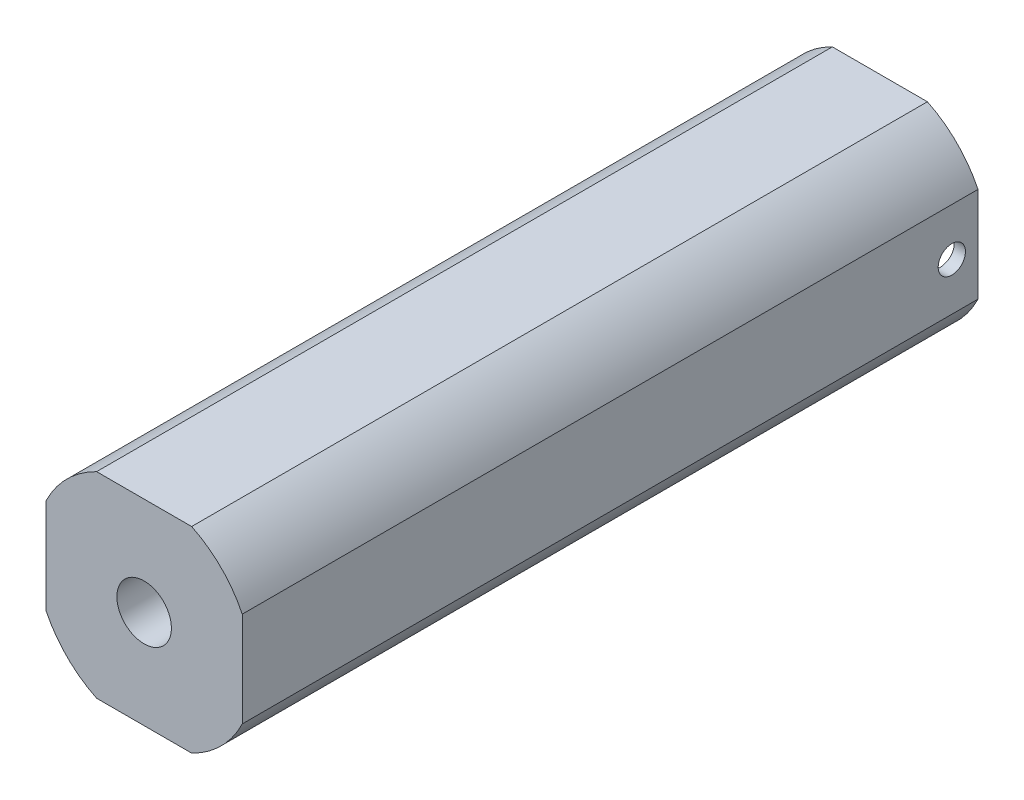
ISO-10303-21;
HEADER;
FILE_DESCRIPTION(('STEP AP214'),'2;1');
FILE_NAME('part.step','',(''),(''),'','','');
FILE_SCHEMA(('AUTOMOTIVE_DESIGN { 1 0 10303 214 1 1 1 1 }'));
ENDSEC;
DATA;
#1=APPLICATION_CONTEXT('core data for automotive mechanical design processes');
#2=APPLICATION_PROTOCOL_DEFINITION('international standard','automotive_design',2000,#1);
#3=PRODUCT_CONTEXT('',#1,'mechanical');
#4=PRODUCT('Part','Part','',(#3));
#5=PRODUCT_RELATED_PRODUCT_CATEGORY('part','',(#4));
#6=PRODUCT_DEFINITION_FORMATION('','',#4);
#7=PRODUCT_DEFINITION_CONTEXT('part definition',#1,'design');
#8=PRODUCT_DEFINITION('design','',#6,#7);
#9=PRODUCT_DEFINITION_SHAPE('','',#8);
#10=(LENGTH_UNIT() NAMED_UNIT(*) SI_UNIT(.MILLI.,.METRE.));
#11=(NAMED_UNIT(*) PLANE_ANGLE_UNIT() SI_UNIT($,.RADIAN.));
#12=(NAMED_UNIT(*) SI_UNIT($,.STERADIAN.) SOLID_ANGLE_UNIT());
#13=UNCERTAINTY_MEASURE_WITH_UNIT(LENGTH_MEASURE(1.E-05),#10,'distance_accuracy_value','');
#14=(GEOMETRIC_REPRESENTATION_CONTEXT(3) GLOBAL_UNCERTAINTY_ASSIGNED_CONTEXT((#13)) GLOBAL_UNIT_ASSIGNED_CONTEXT((#10,
#11,#12)) REPRESENTATION_CONTEXT('',''));
#15=CARTESIAN_POINT('',(0.,0.,0.));
#16=DIRECTION('',(0.,0.,1.));
#17=DIRECTION('',(1.,0.,0.));
#18=AXIS2_PLACEMENT_3D('',#15,#16,#17);
#19=CARTESIAN_POINT('',(5.715,0.,1.524));
#20=DIRECTION('',(1.,0.,0.));
#21=DIRECTION('',(0.,0.,-1.));
#22=AXIS2_PLACEMENT_3D('',#19,#20,#21);
#23=CYLINDRICAL_SURFACE('',#22,0.793749999999993);
#24=CARTESIAN_POINT('',(-5.715,0.,1.524));
#25=DIRECTION('',(1.,0.,0.));
#26=DIRECTION('',(0.,0.,-1.));
#27=AXIS2_PLACEMENT_3D('',#24,#25,#26);
#28=CIRCLE('',#27,0.793749999999998);
#29=CARTESIAN_POINT('',(-5.715,0.,0.730250000000002));
#30=VERTEX_POINT('',#29);
#31=EDGE_CURVE('E255',#30,#30,#28,.T.);
#32=ORIENTED_EDGE('',*,*,#31,.F.);
#33=EDGE_LOOP('',(#32));
#34=FACE_BOUND('',#33,.T.);
#35=DIRECTION('',(1.,0.,0.));
#36=VECTOR('',#35,1.);
#37=CARTESIAN_POINT('',(5.715,0.793749999999992,1.524));
#38=LINE('',#37,#36);
#39=CARTESIAN_POINT('',(-4.98722978591322,0.793749999999992,1.524));
#40=VERTEX_POINT('',#39);
#41=CARTESIAN_POINT('',(-1.37481532850779,0.793749999999992,1.524));
#42=VERTEX_POINT('',#41);
#43=EDGE_CURVE('E147',#40,#42,#38,.T.);
#44=ORIENTED_EDGE('',*,*,#43,.T.);
#45=CARTESIAN_POINT('',(-1.37481532850779,0.793749999999992,1.524));
#46=CARTESIAN_POINT('',(-1.37481120068295,0.793751548047932,1.54479310900535));
#47=CARTESIAN_POINT('',(-1.37528763237443,0.792932425791918,1.56557440346919));
#48=CARTESIAN_POINT('',(-1.37716153918056,0.789675725626614,1.60695547031495));
#49=CARTESIAN_POINT('',(-1.3785584484001,0.787239142100267,1.62755534634995));
#50=CARTESIAN_POINT('',(-1.38404656048011,0.777578565468496,1.68861539087145));
#51=CARTESIAN_POINT('',(-1.3894362164379,0.768003039429198,1.72861351858932));
#52=CARTESIAN_POINT('',(-1.40294232014448,0.743038695222402,1.80611958490734));
#53=CARTESIAN_POINT('',(-1.41105321941882,0.727661698073777,1.84363240603644));
#54=CARTESIAN_POINT('',(-1.42907388604212,0.691599737770301,1.91560119201838));
#55=CARTESIAN_POINT('',(-1.43898643368143,0.670906550013011,1.95005230798813));
#56=CARTESIAN_POINT('',(-1.46047638165587,0.622826206532706,2.01795994715503));
#57=CARTESIAN_POINT('',(-1.47212363920338,0.59502998576522,2.05110466902572));
#58=CARTESIAN_POINT('',(-1.49520521865605,0.534387765510085,2.11249911084665));
#59=CARTESIAN_POINT('',(-1.50663948204262,0.501540400546483,2.14074750276635));
#60=CARTESIAN_POINT('',(-1.5289329236323,0.429013739057547,2.19342262704268));
#61=CARTESIAN_POINT('',(-1.53970113557088,0.389022890666574,2.21746250811572));
#62=CARTESIAN_POINT('',(-1.55853406575365,0.304924977803923,2.25833040772543));
#63=CARTESIAN_POINT('',(-1.56660046884619,0.260820500614724,2.27516292260659));
#64=CARTESIAN_POINT('',(-1.57861361375483,0.173073519750101,2.29989423153083));
#65=CARTESIAN_POINT('',(-1.58281268094781,0.129621508168551,2.30834354986424));
#66=CARTESIAN_POINT('',(-1.58756018721391,0.041728664850789,2.31788183697086));
#67=CARTESIAN_POINT('',(-1.58811077570531,-0.00271156920906823,2.31897513937941));
#68=CARTESIAN_POINT('',(-1.58561865764418,-0.0871799519738248,2.3139823054954));
#69=CARTESIAN_POINT('',(-1.5828842586053,-0.127255718477274,2.30851222189644));
#70=CARTESIAN_POINT('',(-1.57459546562179,-0.205831043850216,2.29165061067763));
#71=CARTESIAN_POINT('',(-1.56904091444393,-0.244330514706431,2.28025875289755));
#72=CARTESIAN_POINT('',(-1.55552449336842,-0.319332798183965,2.25180332590527));
#73=CARTESIAN_POINT('',(-1.54753037552344,-0.35580060998047,2.23466345508758));
#74=CARTESIAN_POINT('',(-1.52985520636906,-0.425431098410128,2.19530371853071));
#75=CARTESIAN_POINT('',(-1.52017352653964,-0.458592536349169,2.17308195911406));
#76=CARTESIAN_POINT('',(-1.49895310698289,-0.524010614274918,2.12177864921073));
#77=CARTESIAN_POINT('',(-1.48732533634547,-0.555885980547587,2.09224743150304));
#78=CARTESIAN_POINT('',(-1.46410780280337,-0.614441934405406,2.02836098913946));
#79=CARTESIAN_POINT('',(-1.45251808324772,-0.641117845526091,1.9940014691949));
#80=CARTESIAN_POINT('',(-1.42988637691953,-0.690186942301944,1.91874796663754));
#81=CARTESIAN_POINT('',(-1.41892724685607,-0.712195517712999,1.87757616880457));
#82=CARTESIAN_POINT('',(-1.39996861260648,-0.748780564568772,1.79147550376069));
#83=CARTESIAN_POINT('',(-1.39196203116837,-0.763374840236074,1.74655594138303));
#84=CARTESIAN_POINT('',(-1.38243314944288,-0.780443667743033,1.67170821099589));
#85=CARTESIAN_POINT('',(-1.3796046303165,-0.785412122526092,1.64249657517969));
#86=CARTESIAN_POINT('',(-1.37578347334469,-0.792073649973395,1.58353405355543));
#87=CARTESIAN_POINT('',(-1.37479407648557,-0.793760940659542,1.55378230889952));
#88=CARTESIAN_POINT('',(-1.37481532850779,-0.793749999999993,1.524));
#89=B_SPLINE_CURVE_WITH_KNOTS('',3,(#45,#46,#47,#48,#49,#50,#51,#52,#53,#54,#55,#56,#57,#58,#59,
#60,#61,#62,#63,#64,#65,#66,#67,#68,#69,#70,#71,#72,#73,#74,#75,#76,#77,#78,#79,#80,#81,#82,#83,
#84,#85,#86,#87,#88),.UNSPECIFIED.,.F.,.F.,(4,2,2,2,2,2,2,2,2,2,2,2,2,2,2,2,2,2,2,2,2,4),(0.,
0.0623352688717945,0.124632250710359,0.248405538001463,0.371927976337507,0.495642677515151,
0.629475803639948,0.763345172685624,0.9062539241483,1.0490733910513,1.18172903198414,
1.31430651490921,1.43535513005652,1.55641049482391,1.67914097609559,1.80191726548369,
1.93628958545803,2.07078220971296,2.21390421306423,2.35668088837657,2.44575265494437,
2.53498123962946),.UNSPECIFIED.);
#90=CARTESIAN_POINT('',(-1.37481532850779,-0.793749999999993,1.524));
#91=VERTEX_POINT('',#90);
#92=EDGE_CURVE('E13',#42,#91,#89,.T.);
#93=ORIENTED_EDGE('',*,*,#92,.T.);
#94=DIRECTION('',(1.,0.,0.));
#95=VECTOR('',#94,1.);
#96=CARTESIAN_POINT('',(5.715,-0.793749999999993,1.524));
#97=LINE('',#96,#95);
#98=CARTESIAN_POINT('',(-4.98722978591322,-0.793749999999993,1.524));
#99=VERTEX_POINT('',#98);
#100=EDGE_CURVE('E254',#91,#99,#97,.F.);
#101=ORIENTED_EDGE('',*,*,#100,.T.);
#102=CARTESIAN_POINT('',(-4.98722978591322,0.793749999999992,1.524));
#103=CARTESIAN_POINT('',(-4.9872066833639,0.793789219334262,1.47963756838011));
#104=CARTESIAN_POINT('',(-4.98782107951814,0.790033392833403,1.43529274265546));
#105=CARTESIAN_POINT('',(-4.99015240881652,0.775228551869342,1.34792179708254));
#106=CARTESIAN_POINT('',(-4.99186796545299,0.764188642406801,1.30489410101111));
#107=CARTESIAN_POINT('',(-4.99623049075879,0.735107599884336,1.22131376574351));
#108=CARTESIAN_POINT('',(-4.99887768941663,0.717064737937112,1.18076174060375));
#109=CARTESIAN_POINT('',(-5.00479702850241,0.674514283431929,1.10325915147397));
#110=CARTESIAN_POINT('',(-5.00806916273072,0.65000675500533,1.06630855176174));
#111=CARTESIAN_POINT('',(-5.01490316070743,0.594993566503329,0.996739383177619));
#112=CARTESIAN_POINT('',(-5.01846707250928,0.564442912113078,0.964156590109945));
#113=CARTESIAN_POINT('',(-5.02546475379401,0.498305161518816,0.90455430961267));
#114=CARTESIAN_POINT('',(-5.02889850329861,0.462717296102533,0.877535673412975));
#115=CARTESIAN_POINT('',(-5.0352704496369,0.387284646300696,0.8296985003488));
#116=CARTESIAN_POINT('',(-5.03820593918329,0.347418413705644,0.80891339277859));
#117=CARTESIAN_POINT('',(-5.04322748863827,0.264709057908652,0.774349016873965));
#118=CARTESIAN_POINT('',(-5.04531364650699,0.221866278682943,0.760568940548468));
#119=CARTESIAN_POINT('',(-5.04838714319817,0.134791135786558,0.740514166245125));
#120=CARTESIAN_POINT('',(-5.04938336350059,0.0905730699387207,0.734178772534922));
#121=CARTESIAN_POINT('',(-5.0501952181515,0.00168999467308443,0.729004589199304));
#122=CARTESIAN_POINT('',(-5.05001089609646,-0.0429749981792408,0.730165522740568));
#123=CARTESIAN_POINT('',(-5.0484894594669,-0.131067249272375,0.739903649877849));
#124=CARTESIAN_POINT('',(-5.04716252815968,-0.174501950240656,0.748415333395763));
#125=CARTESIAN_POINT('',(-5.04351632795057,-0.259318546163597,0.772510330853952));
#126=CARTESIAN_POINT('',(-5.04119703759947,-0.30070039672563,0.788093797646751));
#127=CARTESIAN_POINT('',(-5.0358092333181,-0.380434433979363,0.825956542587064));
#128=CARTESIAN_POINT('',(-5.03273765728619,-0.418773368281435,0.848263274908382));
#129=CARTESIAN_POINT('',(-5.02618733109452,-0.491187114050772,0.898918455459933));
#130=CARTESIAN_POINT('',(-5.02270856720823,-0.525261781687077,0.927267107393087));
#131=CARTESIAN_POINT('',(-5.01568736273462,-0.588563748827882,0.989561305106935));
#132=CARTESIAN_POINT('',(-5.01214463880076,-0.617735431514675,1.02356335664203));
#133=CARTESIAN_POINT('',(-5.00542985371922,-0.669976216429962,1.09602134750619));
#134=CARTESIAN_POINT('',(-5.00225789939608,-0.693043562310774,1.13447856411504));
#135=CARTESIAN_POINT('',(-4.99664332279604,-0.732429816816388,1.21482128292843));
#136=CARTESIAN_POINT('',(-4.99420179232728,-0.748738636946967,1.2567117992038));
#137=CARTESIAN_POINT('',(-4.99034202303083,-0.774049865310943,1.3426553407798));
#138=CARTESIAN_POINT('',(-4.98892225235958,-0.783063213608287,1.38670502265868));
#139=CARTESIAN_POINT('',(-4.98780666382852,-0.790117898172034,1.44657101810848));
#140=CARTESIAN_POINT('',(-4.98759051745474,-0.791480526056674,1.46203836505335));
#141=CARTESIAN_POINT('',(-4.98730223001817,-0.793295382228376,1.49300157067905));
#142=CARTESIAN_POINT('',(-4.98722984680789,-0.793749141379495,1.50849733733916));
#143=CARTESIAN_POINT('',(-4.98722978591322,-0.793749999999993,1.524));
#144=B_SPLINE_CURVE_WITH_KNOTS('',3,(#102,#103,#104,#105,#106,#107,#108,#109,#110,#111,#112,
#113,#114,#115,#116,#117,#118,#119,#120,#121,#122,#123,#124,#125,#126,#127,#128,#129,#130,#131,
#132,#133,#134,#135,#136,#137,#138,#139,#140,#141,#142,#143),.UNSPECIFIED.,.F.,.F.,(4,2,2,2,2,2,
2,2,2,2,2,2,2,2,2,2,2,2,2,2,4),(0.,0.132898009972084,0.26563021323135,0.398395206251405,
0.531158882253918,0.664951022522365,0.798763615737858,0.933281491799695,1.06778384845611,
1.20118184080338,1.33457490689852,1.46679129632959,1.59901054367792,1.73177719097589,
1.86454831520087,1.9987364892594,2.13296323023844,2.26738961683118,2.40161404635009,
2.44817995770598,2.49466736902492),.UNSPECIFIED.);
#145=EDGE_CURVE('E152',#40,#99,#144,.T.);
#146=ORIENTED_EDGE('',*,*,#145,.F.);
#147=EDGE_LOOP('',(#44,#93,#101,#146));
#148=FACE_BOUND('',#147,.T.);
#149=ADVANCED_FACE('F46',(#34,#148),#23,.F.);
#150=CARTESIAN_POINT('',(5.715,2.76790082914833,42.8498));
#151=DIRECTION('',(-1.,0.,0.));
#152=DIRECTION('',(0.,0.,1.));
#153=AXIS2_PLACEMENT_3D('',#150,#151,#152);
#154=PLANE('',#153);
#155=DIRECTION('',(0.,1.,0.));
#156=VECTOR('',#155,1.);
#157=CARTESIAN_POINT('',(5.715,2.76790082914833,0.));
#158=LINE('',#157,#156);
#159=CARTESIAN_POINT('',(5.715,-2.76790082914833,0.));
#160=VERTEX_POINT('',#159);
#161=CARTESIAN_POINT('',(5.715,2.76790082914833,0.));
#162=VERTEX_POINT('',#161);
#163=EDGE_CURVE('E194',#160,#162,#158,.T.);
#164=ORIENTED_EDGE('',*,*,#163,.T.);
#165=DIRECTION('',(0.,0.,-1.));
#166=VECTOR('',#165,1.);
#167=CARTESIAN_POINT('',(5.715,2.76790082914833,42.8498));
#168=LINE('',#167,#166);
#169=CARTESIAN_POINT('',(5.715,2.76790082914833,42.8498));
#170=VERTEX_POINT('',#169);
#171=EDGE_CURVE('E204',#170,#162,#168,.T.);
#172=ORIENTED_EDGE('',*,*,#171,.F.);
#173=DIRECTION('',(0.,1.,0.));
#174=VECTOR('',#173,1.);
#175=CARTESIAN_POINT('',(5.715,2.76790082914833,42.8498));
#176=LINE('',#175,#174);
#177=CARTESIAN_POINT('',(5.715,-2.76790082914833,42.8498));
#178=VERTEX_POINT('',#177);
#179=EDGE_CURVE('E177',#178,#170,#176,.T.);
#180=ORIENTED_EDGE('',*,*,#179,.F.);
#181=DIRECTION('',(0.,0.,-1.));
#182=VECTOR('',#181,1.);
#183=CARTESIAN_POINT('',(5.715,-2.76790082914833,42.8498));
#184=LINE('',#183,#182);
#185=EDGE_CURVE('E207',#178,#160,#184,.T.);
#186=ORIENTED_EDGE('',*,*,#185,.T.);
#187=EDGE_LOOP('',(#164,#172,#180,#186));
#188=FACE_BOUND('',#187,.T.);
#189=CARTESIAN_POINT('',(5.715,0.,1.524));
#190=DIRECTION('',(1.,0.,0.));
#191=DIRECTION('',(0.,0.,-1.));
#192=AXIS2_PLACEMENT_3D('',#189,#190,#191);
#193=CIRCLE('',#192,0.793749999999987);
#194=CARTESIAN_POINT('',(5.715,0.,0.730250000000013));
#195=VERTEX_POINT('',#194);
#196=EDGE_CURVE('E257',#195,#195,#193,.T.);
#197=ORIENTED_EDGE('',*,*,#196,.F.);
#198=EDGE_LOOP('',(#197));
#199=FACE_BOUND('',#198,.T.);
#200=ADVANCED_FACE('F273',(#188,#199),#154,.F.);
#201=CARTESIAN_POINT('',(0.,0.,1.524));
#202=DIRECTION('',(0.,0.,-1.));
#203=DIRECTION('',(-1.,0.,0.));
#204=AXIS2_PLACEMENT_3D('',#201,#202,#203);
#205=PLANE('',#204);
#206=CARTESIAN_POINT('',(0.,0.,1.524));
#207=DIRECTION('',(0.,0.,-1.));
#208=DIRECTION('',(-1.,0.,0.));
#209=AXIS2_PLACEMENT_3D('',#206,#207,#208);
#210=CIRCLE('',#209,1.58749999999999);
#211=CARTESIAN_POINT('',(1.37481532850779,0.793749999999992,1.524));
#212=VERTEX_POINT('',#211);
#213=EDGE_CURVE('E66',#42,#212,#210,.T.);
#214=ORIENTED_EDGE('',*,*,#213,.F.);
#215=ORIENTED_EDGE('',*,*,#43,.F.);
#216=CARTESIAN_POINT('',(0.,0.,1.524));
#217=DIRECTION('',(0.,0.,-1.));
#218=DIRECTION('',(-1.,0.,0.));
#219=AXIS2_PLACEMENT_3D('',#216,#217,#218);
#220=CIRCLE('',#219,5.05);
#221=CARTESIAN_POINT('',(4.98722978591322,0.793749999999992,1.524));
#222=VERTEX_POINT('',#221);
#223=EDGE_CURVE('E162',#40,#222,#220,.T.);
#224=ORIENTED_EDGE('',*,*,#223,.T.);
#225=EDGE_CURVE('E73',#212,#222,#38,.T.);
#226=ORIENTED_EDGE('',*,*,#225,.F.);
#227=EDGE_LOOP('',(#214,#215,#224,#226));
#228=FACE_BOUND('',#227,.T.);
#229=ADVANCED_FACE('F145',(#228),#205,.T.);
#230=CARTESIAN_POINT('',(0.,0.,42.8498));
#231=DIRECTION('',(0.,0.,-1.));
#232=DIRECTION('',(-1.,0.,0.));
#233=AXIS2_PLACEMENT_3D('',#230,#231,#232);
#234=CYLINDRICAL_SURFACE('',#233,6.35);
#235=CARTESIAN_POINT('',(0.,0.,0.));
#236=DIRECTION('',(0.,0.,1.));
#237=DIRECTION('',(1.,0.,0.));
#238=AXIS2_PLACEMENT_3D('',#235,#236,#237);
#239=CIRCLE('',#238,6.35);
#240=CARTESIAN_POINT('',(-2.76790082914833,5.715,0.));
#241=VERTEX_POINT('',#240);
#242=CARTESIAN_POINT('',(-5.715,2.76790082914833,0.));
#243=VERTEX_POINT('',#242);
#244=EDGE_CURVE('E163',#241,#243,#239,.T.);
#245=ORIENTED_EDGE('',*,*,#244,.T.);
#246=DIRECTION('',(0.,0.,-1.));
#247=VECTOR('',#246,1.);
#248=CARTESIAN_POINT('',(-5.715,2.76790082914833,42.8498));
#249=LINE('',#248,#247);
#250=CARTESIAN_POINT('',(-5.715,2.76790082914833,42.8498));
#251=VERTEX_POINT('',#250);
#252=EDGE_CURVE('E219',#251,#243,#249,.T.);
#253=ORIENTED_EDGE('',*,*,#252,.F.);
#254=CARTESIAN_POINT('',(0.,0.,42.8498));
#255=DIRECTION('',(0.,0.,1.));
#256=DIRECTION('',(1.,0.,0.));
#257=AXIS2_PLACEMENT_3D('',#254,#255,#256);
#258=CIRCLE('',#257,6.35);
#259=CARTESIAN_POINT('',(-2.76790082914833,5.715,42.8498));
#260=VERTEX_POINT('',#259);
#261=EDGE_CURVE('E165',#260,#251,#258,.T.);
#262=ORIENTED_EDGE('',*,*,#261,.F.);
#263=DIRECTION('',(0.,0.,-1.));
#264=VECTOR('',#263,1.);
#265=CARTESIAN_POINT('',(-2.76790082914833,5.715,42.8498));
#266=LINE('',#265,#264);
#267=EDGE_CURVE('E183',#260,#241,#266,.T.);
#268=ORIENTED_EDGE('',*,*,#267,.T.);
#269=EDGE_LOOP('',(#245,#253,#262,#268));
#270=FACE_BOUND('',#269,.T.);
#271=ADVANCED_FACE('F48',(#270),#234,.T.);
#272=CARTESIAN_POINT('',(-5.715,2.76790082914833,42.8498));
#273=DIRECTION('',(1.,0.,0.));
#274=DIRECTION('',(0.,0.,-1.));
#275=AXIS2_PLACEMENT_3D('',#272,#273,#274);
#276=PLANE('',#275);
#277=ORIENTED_EDGE('',*,*,#31,.T.);
#278=EDGE_LOOP('',(#277));
#279=FACE_BOUND('',#278,.T.);
#280=DIRECTION('',(0.,-1.,0.));
#281=VECTOR('',#280,1.);
#282=CARTESIAN_POINT('',(-5.715,2.76790082914833,0.));
#283=LINE('',#282,#281);
#284=CARTESIAN_POINT('',(-5.715,-2.76790082914833,0.));
#285=VERTEX_POINT('',#284);
#286=EDGE_CURVE('E186',#243,#285,#283,.T.);
#287=ORIENTED_EDGE('',*,*,#286,.T.);
#288=DIRECTION('',(0.,0.,-1.));
#289=VECTOR('',#288,1.);
#290=CARTESIAN_POINT('',(-5.715,-2.76790082914833,42.8498));
#291=LINE('',#290,#289);
#292=CARTESIAN_POINT('',(-5.715,-2.76790082914833,42.8498));
#293=VERTEX_POINT('',#292);
#294=EDGE_CURVE('E216',#293,#285,#291,.T.);
#295=ORIENTED_EDGE('',*,*,#294,.F.);
#296=DIRECTION('',(0.,-1.,0.));
#297=VECTOR('',#296,1.);
#298=CARTESIAN_POINT('',(-5.715,2.76790082914833,42.8498));
#299=LINE('',#298,#297);
#300=EDGE_CURVE('E168',#251,#293,#299,.T.);
#301=ORIENTED_EDGE('',*,*,#300,.F.);
#302=ORIENTED_EDGE('',*,*,#252,.T.);
#303=EDGE_LOOP('',(#287,#295,#301,#302));
#304=FACE_BOUND('',#303,.T.);
#305=ADVANCED_FACE('F298',(#279,#304),#276,.F.);
#306=CARTESIAN_POINT('',(0.,0.,42.8498));
#307=DIRECTION('',(0.,0.,-1.));
#308=DIRECTION('',(-1.,0.,0.));
#309=AXIS2_PLACEMENT_3D('',#306,#307,#308);
#310=CYLINDRICAL_SURFACE('',#309,6.35);
#311=CARTESIAN_POINT('',(0.,0.,0.));
#312=DIRECTION('',(0.,0.,1.));
#313=DIRECTION('',(1.,0.,0.));
#314=AXIS2_PLACEMENT_3D('',#311,#312,#313);
#315=CIRCLE('',#314,6.35);
#316=CARTESIAN_POINT('',(-2.76790082914833,-5.715,0.));
#317=VERTEX_POINT('',#316);
#318=EDGE_CURVE('E188',#285,#317,#315,.T.);
#319=ORIENTED_EDGE('',*,*,#318,.T.);
#320=DIRECTION('',(0.,0.,-1.));
#321=VECTOR('',#320,1.);
#322=CARTESIAN_POINT('',(-2.76790082914833,-5.715,42.8498));
#323=LINE('',#322,#321);
#324=CARTESIAN_POINT('',(-2.76790082914833,-5.715,42.8498));
#325=VERTEX_POINT('',#324);
#326=EDGE_CURVE('E213',#325,#317,#323,.T.);
#327=ORIENTED_EDGE('',*,*,#326,.F.);
#328=CARTESIAN_POINT('',(0.,0.,42.8498));
#329=DIRECTION('',(0.,0.,1.));
#330=DIRECTION('',(1.,0.,0.));
#331=AXIS2_PLACEMENT_3D('',#328,#329,#330);
#332=CIRCLE('',#331,6.35);
#333=EDGE_CURVE('E171',#293,#325,#332,.T.);
#334=ORIENTED_EDGE('',*,*,#333,.F.);
#335=ORIENTED_EDGE('',*,*,#294,.T.);
#336=EDGE_LOOP('',(#319,#327,#334,#335));
#337=FACE_BOUND('',#336,.T.);
#338=ADVANCED_FACE('F295',(#337),#310,.T.);
#339=CARTESIAN_POINT('',(-2.76790082914833,-5.715,42.8498));
#340=DIRECTION('',(0.,1.,0.));
#341=DIRECTION('',(0.,0.,1.));
#342=AXIS2_PLACEMENT_3D('',#339,#340,#341);
#343=PLANE('',#342);
#344=DIRECTION('',(1.,0.,0.));
#345=VECTOR('',#344,1.);
#346=CARTESIAN_POINT('',(-2.76790082914833,-5.715,0.));
#347=LINE('',#346,#345);
#348=CARTESIAN_POINT('',(2.76790082914833,-5.715,0.));
#349=VERTEX_POINT('',#348);
#350=EDGE_CURVE('E190',#317,#349,#347,.T.);
#351=ORIENTED_EDGE('',*,*,#350,.T.);
#352=DIRECTION('',(0.,0.,-1.));
#353=VECTOR('',#352,1.);
#354=CARTESIAN_POINT('',(2.76790082914833,-5.715,42.8498));
#355=LINE('',#354,#353);
#356=CARTESIAN_POINT('',(2.76790082914833,-5.715,42.8498));
#357=VERTEX_POINT('',#356);
#358=EDGE_CURVE('E210',#357,#349,#355,.T.);
#359=ORIENTED_EDGE('',*,*,#358,.F.);
#360=DIRECTION('',(1.,0.,0.));
#361=VECTOR('',#360,1.);
#362=CARTESIAN_POINT('',(-2.76790082914833,-5.715,42.8498));
#363=LINE('',#362,#361);
#364=EDGE_CURVE('E173',#325,#357,#363,.T.);
#365=ORIENTED_EDGE('',*,*,#364,.F.);
#366=ORIENTED_EDGE('',*,*,#326,.T.);
#367=EDGE_LOOP('',(#351,#359,#365,#366));
#368=FACE_BOUND('',#367,.T.);
#369=ADVANCED_FACE('F291',(#368),#343,.F.);
#370=CARTESIAN_POINT('',(0.,0.,42.8498));
#371=DIRECTION('',(0.,0.,-1.));
#372=DIRECTION('',(-1.,0.,0.));
#373=AXIS2_PLACEMENT_3D('',#370,#371,#372);
#374=CYLINDRICAL_SURFACE('',#373,6.35);
#375=CARTESIAN_POINT('',(0.,0.,0.));
#376=DIRECTION('',(0.,0.,1.));
#377=DIRECTION('',(1.,0.,0.));
#378=AXIS2_PLACEMENT_3D('',#375,#376,#377);
#379=CIRCLE('',#378,6.35);
#380=EDGE_CURVE('E192',#349,#160,#379,.T.);
#381=ORIENTED_EDGE('',*,*,#380,.T.);
#382=ORIENTED_EDGE('',*,*,#185,.F.);
#383=CARTESIAN_POINT('',(0.,0.,42.8498));
#384=DIRECTION('',(0.,0.,1.));
#385=DIRECTION('',(1.,0.,0.));
#386=AXIS2_PLACEMENT_3D('',#383,#384,#385);
#387=CIRCLE('',#386,6.35);
#388=EDGE_CURVE('E175',#357,#178,#387,.T.);
#389=ORIENTED_EDGE('',*,*,#388,.F.);
#390=ORIENTED_EDGE('',*,*,#358,.T.);
#391=EDGE_LOOP('',(#381,#382,#389,#390));
#392=FACE_BOUND('',#391,.T.);
#393=ADVANCED_FACE('F288',(#392),#374,.T.);
#394=CARTESIAN_POINT('',(0.,0.,42.8498));
#395=DIRECTION('',(0.,0.,-1.));
#396=DIRECTION('',(-1.,0.,0.));
#397=AXIS2_PLACEMENT_3D('',#394,#395,#396);
#398=CYLINDRICAL_SURFACE('',#397,6.35);
#399=CARTESIAN_POINT('',(0.,0.,0.));
#400=DIRECTION('',(0.,0.,1.));
#401=DIRECTION('',(1.,0.,0.));
#402=AXIS2_PLACEMENT_3D('',#399,#400,#401);
#403=CIRCLE('',#402,6.35);
#404=CARTESIAN_POINT('',(2.76790082914833,5.715,0.));
#405=VERTEX_POINT('',#404);
#406=EDGE_CURVE('E196',#162,#405,#403,.T.);
#407=ORIENTED_EDGE('',*,*,#406,.T.);
#408=DIRECTION('',(0.,0.,-1.));
#409=VECTOR('',#408,1.);
#410=CARTESIAN_POINT('',(2.76790082914833,5.715,42.8498));
#411=LINE('',#410,#409);
#412=CARTESIAN_POINT('',(2.76790082914833,5.715,42.8498));
#413=VERTEX_POINT('',#412);
#414=EDGE_CURVE('E201',#413,#405,#411,.T.);
#415=ORIENTED_EDGE('',*,*,#414,.F.);
#416=CARTESIAN_POINT('',(0.,0.,42.8498));
#417=DIRECTION('',(0.,0.,1.));
#418=DIRECTION('',(1.,0.,0.));
#419=AXIS2_PLACEMENT_3D('',#416,#417,#418);
#420=CIRCLE('',#419,6.35);
#421=EDGE_CURVE('E179',#170,#413,#420,.T.);
#422=ORIENTED_EDGE('',*,*,#421,.F.);
#423=ORIENTED_EDGE('',*,*,#171,.T.);
#424=EDGE_LOOP('',(#407,#415,#422,#423));
#425=FACE_BOUND('',#424,.T.);
#426=ADVANCED_FACE('F286',(#425),#398,.T.);
#427=CARTESIAN_POINT('',(-2.76790082914833,5.715,42.8498));
#428=DIRECTION('',(0.,-1.,0.));
#429=DIRECTION('',(0.,0.,-1.));
#430=AXIS2_PLACEMENT_3D('',#427,#428,#429);
#431=PLANE('',#430);
#432=DIRECTION('',(-1.,0.,0.));
#433=VECTOR('',#432,1.);
#434=CARTESIAN_POINT('',(-2.76790082914833,5.715,0.));
#435=LINE('',#434,#433);
#436=EDGE_CURVE('E169',#405,#241,#435,.T.);
#437=ORIENTED_EDGE('',*,*,#436,.T.);
#438=ORIENTED_EDGE('',*,*,#267,.F.);
#439=DIRECTION('',(-1.,0.,0.));
#440=VECTOR('',#439,1.);
#441=CARTESIAN_POINT('',(-2.76790082914833,5.715,42.8498));
#442=LINE('',#441,#440);
#443=EDGE_CURVE('E181',#413,#260,#442,.T.);
#444=ORIENTED_EDGE('',*,*,#443,.F.);
#445=ORIENTED_EDGE('',*,*,#414,.T.);
#446=EDGE_LOOP('',(#437,#438,#444,#445));
#447=FACE_BOUND('',#446,.T.);
#448=ADVANCED_FACE('F329',(#447),#431,.F.);
#449=CARTESIAN_POINT('',(0.,0.,42.8498));
#450=DIRECTION('',(0.,0.,1.));
#451=DIRECTION('',(1.,0.,0.));
#452=AXIS2_PLACEMENT_3D('',#449,#450,#451);
#453=PLANE('',#452);
#454=CARTESIAN_POINT('',(0.,0.,42.8498));
#455=DIRECTION('',(0.,0.,-1.));
#456=DIRECTION('',(-1.,0.,0.));
#457=AXIS2_PLACEMENT_3D('',#454,#455,#456);
#458=CIRCLE('',#457,1.58749999999999);
#459=CARTESIAN_POINT('',(-1.58749999999999,0.,42.8498));
#460=VERTEX_POINT('',#459);
#461=EDGE_CURVE('E149',#460,#460,#458,.T.);
#462=ORIENTED_EDGE('',*,*,#461,.T.);
#463=EDGE_LOOP('',(#462));
#464=FACE_BOUND('',#463,.T.);
#465=ORIENTED_EDGE('',*,*,#261,.T.);
#466=ORIENTED_EDGE('',*,*,#300,.T.);
#467=ORIENTED_EDGE('',*,*,#333,.T.);
#468=ORIENTED_EDGE('',*,*,#364,.T.);
#469=ORIENTED_EDGE('',*,*,#388,.T.);
#470=ORIENTED_EDGE('',*,*,#179,.T.);
#471=ORIENTED_EDGE('',*,*,#421,.T.);
#472=ORIENTED_EDGE('',*,*,#443,.T.);
#473=EDGE_LOOP('',(#465,#466,#467,#468,#469,#470,#471,#472));
#474=FACE_BOUND('',#473,.T.);
#475=ADVANCED_FACE('F266',(#464,#474),#453,.T.);
#476=CARTESIAN_POINT('',(0.,0.,0.));
#477=DIRECTION('',(0.,0.,1.));
#478=DIRECTION('',(1.,0.,0.));
#479=AXIS2_PLACEMENT_3D('',#476,#477,#478);
#480=PLANE('',#479);
#481=CARTESIAN_POINT('',(0.,0.,0.));
#482=DIRECTION('',(0.,0.,-1.));
#483=DIRECTION('',(-1.,0.,0.));
#484=AXIS2_PLACEMENT_3D('',#481,#482,#483);
#485=CIRCLE('',#484,5.05);
#486=CARTESIAN_POINT('',(-5.05,0.,0.));
#487=VERTEX_POINT('',#486);
#488=EDGE_CURVE('E153',#487,#487,#485,.T.);
#489=ORIENTED_EDGE('',*,*,#488,.F.);
#490=EDGE_LOOP('',(#489));
#491=FACE_BOUND('',#490,.T.);
#492=ORIENTED_EDGE('',*,*,#244,.F.);
#493=ORIENTED_EDGE('',*,*,#436,.F.);
#494=ORIENTED_EDGE('',*,*,#406,.F.);
#495=ORIENTED_EDGE('',*,*,#163,.F.);
#496=ORIENTED_EDGE('',*,*,#380,.F.);
#497=ORIENTED_EDGE('',*,*,#350,.F.);
#498=ORIENTED_EDGE('',*,*,#318,.F.);
#499=ORIENTED_EDGE('',*,*,#286,.F.);
#500=EDGE_LOOP('',(#492,#493,#494,#495,#496,#497,#498,#499));
#501=FACE_BOUND('',#500,.T.);
#502=ADVANCED_FACE('F314',(#491,#501),#480,.F.);
#503=CARTESIAN_POINT('',(0.,0.,1.524));
#504=DIRECTION('',(0.,0.,-1.));
#505=DIRECTION('',(-1.,0.,0.));
#506=AXIS2_PLACEMENT_3D('',#503,#504,#505);
#507=CYLINDRICAL_SURFACE('',#506,5.05);
#508=ORIENTED_EDGE('',*,*,#223,.F.);
#509=ORIENTED_EDGE('',*,*,#145,.T.);
#510=CARTESIAN_POINT('',(4.98722978591322,-0.793749999999993,1.524));
#511=VERTEX_POINT('',#510);
#512=EDGE_CURVE('E156',#511,#99,#220,.T.);
#513=ORIENTED_EDGE('',*,*,#512,.F.);
#514=CARTESIAN_POINT('',(4.98722978591322,-0.793749999999993,1.524));
#515=CARTESIAN_POINT('',(4.9872066833639,-0.793789219334262,1.47963756838011));
#516=CARTESIAN_POINT('',(4.98782107951814,-0.790033392833403,1.43529274265546));
#517=CARTESIAN_POINT('',(4.99015240881652,-0.775228551869342,1.34792179708254));
#518=CARTESIAN_POINT('',(4.99186796545299,-0.764188642406801,1.30489410101111));
#519=CARTESIAN_POINT('',(4.99623049075879,-0.735107599884337,1.22131376574351));
#520=CARTESIAN_POINT('',(4.99887768941663,-0.717064737937112,1.18076174060375));
#521=CARTESIAN_POINT('',(5.00479702850241,-0.67451428343193,1.10325915147397));
#522=CARTESIAN_POINT('',(5.00806916273072,-0.65000675500533,1.06630855176174));
#523=CARTESIAN_POINT('',(5.01490316070743,-0.59499356650333,0.996739383177619));
#524=CARTESIAN_POINT('',(5.01846707250928,-0.564442912113079,0.964156590109945));
#525=CARTESIAN_POINT('',(5.02546475379401,-0.498305161518816,0.90455430961267));
#526=CARTESIAN_POINT('',(5.02889850329861,-0.462717296102533,0.877535673412975));
#527=CARTESIAN_POINT('',(5.0352704496369,-0.387284646300696,0.8296985003488));
#528=CARTESIAN_POINT('',(5.03820593918329,-0.347418413705645,0.80891339277859));
#529=CARTESIAN_POINT('',(5.04322748863827,-0.264709057908653,0.774349016873965));
#530=CARTESIAN_POINT('',(5.04531364650699,-0.221866278682943,0.760568940548468));
#531=CARTESIAN_POINT('',(5.04838714319817,-0.134791135786558,0.740514166245125));
#532=CARTESIAN_POINT('',(5.04938336350059,-0.090573069938721,0.734178772534922));
#533=CARTESIAN_POINT('',(5.0501952181515,-0.00168999467308477,0.729004589199304));
#534=CARTESIAN_POINT('',(5.05001089609646,0.0429749981792403,0.730165522740568));
#535=CARTESIAN_POINT('',(5.0484894594669,0.131067249272374,0.739903649877849));
#536=CARTESIAN_POINT('',(5.04716252815968,0.174501950240655,0.748415333395763));
#537=CARTESIAN_POINT('',(5.04351632795057,0.259318546163597,0.772510330853952));
#538=CARTESIAN_POINT('',(5.04119703759947,0.30070039672563,0.788093797646751));
#539=CARTESIAN_POINT('',(5.0358092333181,0.380434433979363,0.825956542587064));
#540=CARTESIAN_POINT('',(5.03273765728619,0.418773368281434,0.848263274908381));
#541=CARTESIAN_POINT('',(5.02618733109452,0.491187114050771,0.898918455459933));
#542=CARTESIAN_POINT('',(5.02270856720823,0.525261781687076,0.927267107393087));
#543=CARTESIAN_POINT('',(5.01568736273462,0.588563748827882,0.989561305106935));
#544=CARTESIAN_POINT('',(5.01214463880076,0.617735431514674,1.02356335664203));
#545=CARTESIAN_POINT('',(5.00542985371922,0.669976216429962,1.09602134750619));
#546=CARTESIAN_POINT('',(5.00225789939608,0.693043562310773,1.13447856411504));
#547=CARTESIAN_POINT('',(4.99664332279604,0.732429816816388,1.21482128292843));
#548=CARTESIAN_POINT('',(4.99420179232728,0.748738636946967,1.2567117992038));
#549=CARTESIAN_POINT('',(4.99034202303083,0.774049865310943,1.3426553407798));
#550=CARTESIAN_POINT('',(4.98892225235958,0.783063213608286,1.38670502265868));
#551=CARTESIAN_POINT('',(4.98780666382853,0.790117898172033,1.44657101810848));
#552=CARTESIAN_POINT('',(4.98759051745474,0.791480526056674,1.46203836505335));
#553=CARTESIAN_POINT('',(4.98730223001817,0.793295382228376,1.49300157067905));
#554=CARTESIAN_POINT('',(4.98722984680789,0.793749141379494,1.50849733733916));
#555=CARTESIAN_POINT('',(4.98722978591322,0.793749999999993,1.524));
#556=B_SPLINE_CURVE_WITH_KNOTS('',3,(#514,#515,#516,#517,#518,#519,#520,#521,#522,#523,#524,
#525,#526,#527,#528,#529,#530,#531,#532,#533,#534,#535,#536,#537,#538,#539,#540,#541,#542,#543,
#544,#545,#546,#547,#548,#549,#550,#551,#552,#553,#554,#555),.UNSPECIFIED.,.F.,.F.,(4,2,2,2,2,2,
2,2,2,2,2,2,2,2,2,2,2,2,2,2,4),(0.,0.132898009972084,0.26563021323135,0.398395206251405,
0.531158882253918,0.664951022522365,0.798763615737858,0.933281491799695,1.06778384845611,
1.20118184080338,1.33457490689852,1.46679129632959,1.59901054367792,1.73177719097589,
1.86454831520087,1.9987364892594,2.13296323023844,2.26738961683118,2.40161404635009,
2.44817995770598,2.49466736902492),.UNSPECIFIED.);
#557=EDGE_CURVE('E222',#511,#222,#556,.T.);
#558=ORIENTED_EDGE('',*,*,#557,.T.);
#559=EDGE_LOOP('',(#508,#509,#513,#558));
#560=FACE_BOUND('',#559,.T.);
#561=ORIENTED_EDGE('',*,*,#488,.T.);
#562=EDGE_LOOP('',(#561));
#563=FACE_BOUND('',#562,.T.);
#564=ADVANCED_FACE('F231',(#560,#563),#507,.F.);
#565=CARTESIAN_POINT('',(1.37481532850779,-0.793749999999993,1.524));
#566=VERTEX_POINT('',#565);
#567=EDGE_CURVE('E139',#566,#91,#210,.T.);
#568=ORIENTED_EDGE('',*,*,#567,.F.);
#569=EDGE_CURVE('E158',#511,#566,#97,.F.);
#570=ORIENTED_EDGE('',*,*,#569,.F.);
#571=ORIENTED_EDGE('',*,*,#512,.T.);
#572=ORIENTED_EDGE('',*,*,#100,.F.);
#573=EDGE_LOOP('',(#568,#570,#571,#572));
#574=FACE_BOUND('',#573,.T.);
#575=ADVANCED_FACE('F238',(#574),#205,.T.);
#576=ORIENTED_EDGE('',*,*,#196,.T.);
#577=EDGE_LOOP('',(#576));
#578=FACE_BOUND('',#577,.T.);
#579=ORIENTED_EDGE('',*,*,#569,.T.);
#580=CARTESIAN_POINT('',(1.37481532850779,-0.793749999999993,1.524));
#581=CARTESIAN_POINT('',(1.37481120068295,-0.793751548047932,1.54479310900535));
#582=CARTESIAN_POINT('',(1.37528763237443,-0.792932425791918,1.56557440346919));
#583=CARTESIAN_POINT('',(1.37716153918056,-0.789675725626614,1.60695547031495));
#584=CARTESIAN_POINT('',(1.3785584484001,-0.787239142100267,1.62755534634995));
#585=CARTESIAN_POINT('',(1.38404656048011,-0.777578565468497,1.68861539087145));
#586=CARTESIAN_POINT('',(1.3894362164379,-0.768003039429199,1.72861351858932));
#587=CARTESIAN_POINT('',(1.40294232014448,-0.743038695222402,1.80611958490734));
#588=CARTESIAN_POINT('',(1.41105321941882,-0.727661698073777,1.84363240603644));
#589=CARTESIAN_POINT('',(1.42907388604212,-0.691599737770302,1.91560119201838));
#590=CARTESIAN_POINT('',(1.43898643368143,-0.670906550013012,1.95005230798813));
#591=CARTESIAN_POINT('',(1.46047638165587,-0.622826206532707,2.01795994715503));
#592=CARTESIAN_POINT('',(1.47212363920338,-0.595029985765221,2.05110466902572));
#593=CARTESIAN_POINT('',(1.49520521865605,-0.534387765510085,2.11249911084665));
#594=CARTESIAN_POINT('',(1.50663948204262,-0.501540400546483,2.14074750276635));
#595=CARTESIAN_POINT('',(1.5289329236323,-0.429013739057547,2.19342262704268));
#596=CARTESIAN_POINT('',(1.53970113557088,-0.389022890666575,2.21746250811572));
#597=CARTESIAN_POINT('',(1.55853406575365,-0.304924977803923,2.25833040772543));
#598=CARTESIAN_POINT('',(1.56660046884619,-0.260820500614724,2.27516292260659));
#599=CARTESIAN_POINT('',(1.57861361375483,-0.173073519750102,2.29989423153083));
#600=CARTESIAN_POINT('',(1.58281268094781,-0.129621508168551,2.30834354986424));
#601=CARTESIAN_POINT('',(1.58756018721391,-0.0417286648507896,2.31788183697086));
#602=CARTESIAN_POINT('',(1.58811077570531,0.00271156920906769,2.31897513937941));
#603=CARTESIAN_POINT('',(1.58561865764418,0.0871799519738243,2.3139823054954));
#604=CARTESIAN_POINT('',(1.5828842586053,0.127255718477274,2.30851222189644));
#605=CARTESIAN_POINT('',(1.57459546562179,0.205831043850216,2.29165061067763));
#606=CARTESIAN_POINT('',(1.56904091444393,0.24433051470643,2.28025875289755));
#607=CARTESIAN_POINT('',(1.55552449336842,0.319332798183964,2.25180332590527));
#608=CARTESIAN_POINT('',(1.54753037552344,0.35580060998047,2.23466345508758));
#609=CARTESIAN_POINT('',(1.52985520636906,0.425431098410128,2.19530371853071));
#610=CARTESIAN_POINT('',(1.52017352653964,0.458592536349168,2.17308195911406));
#611=CARTESIAN_POINT('',(1.49895310698289,0.524010614274917,2.12177864921073));
#612=CARTESIAN_POINT('',(1.48732533634547,0.555885980547586,2.09224743150304));
#613=CARTESIAN_POINT('',(1.46410780280337,0.614441934405405,2.02836098913946));
#614=CARTESIAN_POINT('',(1.45251808324773,0.64111784552609,1.9940014691949));
#615=CARTESIAN_POINT('',(1.42988637691953,0.690186942301943,1.91874796663754));
#616=CARTESIAN_POINT('',(1.41892724685607,0.712195517712999,1.87757616880457));
#617=CARTESIAN_POINT('',(1.39996861260648,0.748780564568772,1.79147550376069));
#618=CARTESIAN_POINT('',(1.39196203116837,0.763374840236073,1.74655594138303));
#619=CARTESIAN_POINT('',(1.38243314944288,0.780443667743033,1.67170821099589));
#620=CARTESIAN_POINT('',(1.3796046303165,0.785412122526091,1.64249657517969));
#621=CARTESIAN_POINT('',(1.37578347334469,0.792073649973395,1.58353405355543));
#622=CARTESIAN_POINT('',(1.37479407648557,0.793760940659542,1.55378230889952));
#623=CARTESIAN_POINT('',(1.37481532850779,0.793749999999992,1.524));
#624=B_SPLINE_CURVE_WITH_KNOTS('',3,(#580,#581,#582,#583,#584,#585,#586,#587,#588,#589,#590,
#591,#592,#593,#594,#595,#596,#597,#598,#599,#600,#601,#602,#603,#604,#605,#606,#607,#608,#609,
#610,#611,#612,#613,#614,#615,#616,#617,#618,#619,#620,#621,#622,#623),.UNSPECIFIED.,.F.,.F.,(4,
2,2,2,2,2,2,2,2,2,2,2,2,2,2,2,2,2,2,2,2,4),(0.,0.0623352688717945,0.124632250710359,
0.248405538001463,0.371927976337506,0.495642677515151,0.629475803639948,0.763345172685624,
0.9062539241483,1.0490733910513,1.18172903198414,1.31430651490921,1.43535513005652,
1.55641049482391,1.67914097609559,1.80191726548369,1.93628958545803,2.07078220971296,
2.21390421306423,2.35668088837657,2.44575265494437,2.53498123962946),.UNSPECIFIED.);
#625=EDGE_CURVE('E59',#566,#212,#624,.T.);
#626=ORIENTED_EDGE('',*,*,#625,.T.);
#627=ORIENTED_EDGE('',*,*,#225,.T.);
#628=ORIENTED_EDGE('',*,*,#557,.F.);
#629=EDGE_LOOP('',(#579,#626,#627,#628));
#630=FACE_BOUND('',#629,.T.);
#631=ADVANCED_FACE('F235',(#578,#630),#23,.F.);
#632=CARTESIAN_POINT('',(0.,0.,1.524));
#633=DIRECTION('',(0.,0.,-1.));
#634=DIRECTION('',(-1.,0.,0.));
#635=AXIS2_PLACEMENT_3D('',#632,#633,#634);
#636=CYLINDRICAL_SURFACE('',#635,1.58749999999999);
#637=ORIENTED_EDGE('',*,*,#461,.F.);
#638=EDGE_LOOP('',(#637));
#639=FACE_BOUND('',#638,.T.);
#640=ORIENTED_EDGE('',*,*,#213,.T.);
#641=ORIENTED_EDGE('',*,*,#625,.F.);
#642=ORIENTED_EDGE('',*,*,#567,.T.);
#643=ORIENTED_EDGE('',*,*,#92,.F.);
#644=EDGE_LOOP('',(#640,#641,#642,#643));
#645=FACE_BOUND('',#644,.T.);
#646=ADVANCED_FACE('F137',(#639,#645),#636,.F.);
#647=CLOSED_SHELL('',(#149,#200,#229,#271,#305,#338,#369,#393,#426,#448,#475,#502,#564,#575,
#631,#646));
#648=MANIFOLD_SOLID_BREP('B2',#647);
#649=ADVANCED_BREP_SHAPE_REPRESENTATION('',(#18,#648),#14);
#650=SHAPE_DEFINITION_REPRESENTATION(#9,#649);
ENDSEC;
END-ISO-10303-21;
